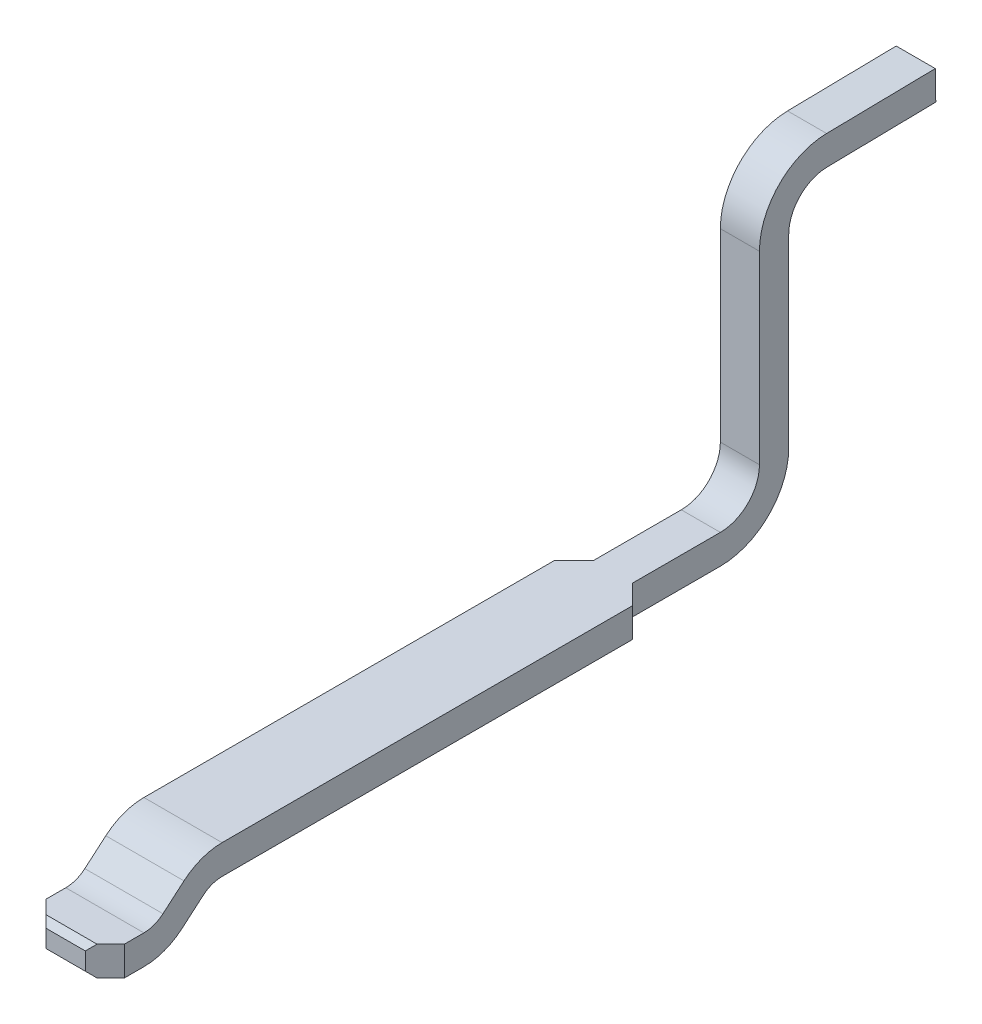
ISO-10303-21;
HEADER;
FILE_DESCRIPTION(('STEP AP214'),'2;1');
FILE_NAME('part.step','',(''),(''),'','','');
FILE_SCHEMA(('AUTOMOTIVE_DESIGN { 1 0 10303 214 1 1 1 1 }'));
ENDSEC;
DATA;
#1=APPLICATION_CONTEXT('core data for automotive mechanical design processes');
#2=APPLICATION_PROTOCOL_DEFINITION('international standard','automotive_design',2000,#1);
#3=PRODUCT_CONTEXT('',#1,'mechanical');
#4=PRODUCT('Part','Part','',(#3));
#5=PRODUCT_RELATED_PRODUCT_CATEGORY('part','',(#4));
#6=PRODUCT_DEFINITION_FORMATION('','',#4);
#7=PRODUCT_DEFINITION_CONTEXT('part definition',#1,'design');
#8=PRODUCT_DEFINITION('design','',#6,#7);
#9=PRODUCT_DEFINITION_SHAPE('','',#8);
#10=(LENGTH_UNIT() NAMED_UNIT(*) SI_UNIT(.MILLI.,.METRE.));
#11=(NAMED_UNIT(*) PLANE_ANGLE_UNIT() SI_UNIT($,.RADIAN.));
#12=(NAMED_UNIT(*) SI_UNIT($,.STERADIAN.) SOLID_ANGLE_UNIT());
#13=UNCERTAINTY_MEASURE_WITH_UNIT(LENGTH_MEASURE(1.E-05),#10,'distance_accuracy_value','');
#14=(GEOMETRIC_REPRESENTATION_CONTEXT(3) GLOBAL_UNCERTAINTY_ASSIGNED_CONTEXT((#13)) GLOBAL_UNIT_ASSIGNED_CONTEXT((#10,
#11,#12)) REPRESENTATION_CONTEXT('',''));
#15=CARTESIAN_POINT('',(0.,0.,0.));
#16=DIRECTION('',(0.,0.,1.));
#17=DIRECTION('',(1.,0.,0.));
#18=AXIS2_PLACEMENT_3D('',#15,#16,#17);
#19=CARTESIAN_POINT('',(-2.89596503503213,8.074228109921,4.324047830079));
#20=DIRECTION('',(0.,0.707106781186548,0.707106781186548));
#21=DIRECTION('',(0.,-0.707106781186548,0.707106781186548));
#22=AXIS2_PLACEMENT_3D('',#19,#20,#21);
#23=PLANE('',#22);
#24=DIRECTION('',(-0.577350269189631,0.577350269189615,-0.577350269189631));
#25=VECTOR('',#24,1.);
#26=CARTESIAN_POINT('',(-2.86026690000013,8.04019892,4.35807702));
#27=LINE('',#26,#25);
#28=CARTESIAN_POINT('',(-2.86026690000013,8.04019892,4.35807702));
#29=VERTEX_POINT('',#28);
#30=CARTESIAN_POINT('',(-2.89026690000013,8.07019892,4.32807702));
#31=VERTEX_POINT('',#30);
#32=EDGE_CURVE('E186',#29,#31,#27,.T.);
#33=ORIENTED_EDGE('',*,*,#32,.F.);
#34=DIRECTION('',(-1.,0.,0.));
#35=VECTOR('',#34,1.);
#36=CARTESIAN_POINT('',(-2.65456876496813,8.04019892,4.35807702));
#37=LINE('',#36,#35);
#38=CARTESIAN_POINT('',(-2.66026690000013,8.04019892,4.35807702));
#39=VERTEX_POINT('',#38);
#40=EDGE_CURVE('E179',#29,#39,#37,.F.);
#41=ORIENTED_EDGE('',*,*,#40,.T.);
#42=DIRECTION('',(-0.577350269189631,-0.577350269189606,0.57735026918964));
#43=VECTOR('',#42,1.);
#44=CARTESIAN_POINT('',(-2.63026690000013,8.07019892,4.32807702));
#45=LINE('',#44,#43);
#46=CARTESIAN_POINT('',(-2.63026690000013,8.07019892,4.32807702));
#47=VERTEX_POINT('',#46);
#48=EDGE_CURVE('E302',#47,#39,#45,.T.);
#49=ORIENTED_EDGE('',*,*,#48,.F.);
#50=DIRECTION('',(1.,0.,0.));
#51=VECTOR('',#50,1.);
#52=CARTESIAN_POINT('',(-2.55226690000013,8.07019892,4.32807702));
#53=LINE('',#52,#51);
#54=EDGE_CURVE('E309',#31,#47,#53,.T.);
#55=ORIENTED_EDGE('',*,*,#54,.F.);
#56=EDGE_LOOP('',(#33,#41,#49,#55));
#57=FACE_BOUND('',#56,.T.);
#58=ADVANCED_FACE('F17',(#57),#23,.T.);
#59=CARTESIAN_POINT('',(-2.65456876496813,7.944500784968,4.35807702));
#60=DIRECTION('',(0.,0.,-1.));
#61=DIRECTION('',(-1.,0.,0.));
#62=AXIS2_PLACEMENT_3D('',#59,#60,#61);
#63=PLANE('',#62);
#64=DIRECTION('',(0.,1.,0.));
#65=VECTOR('',#64,1.);
#66=CARTESIAN_POINT('',(-2.66026690000013,7.914500784968,4.35807702));
#67=LINE('',#66,#65);
#68=CARTESIAN_POINT('',(-2.66026690000013,7.95019892,4.35807702));
#69=VERTEX_POINT('',#68);
#70=EDGE_CURVE('E289',#39,#69,#67,.F.);
#71=ORIENTED_EDGE('',*,*,#70,.F.);
#72=ORIENTED_EDGE('',*,*,#40,.F.);
#73=DIRECTION('',(0.,1.,0.));
#74=VECTOR('',#73,1.);
#75=CARTESIAN_POINT('',(-2.86026690000013,7.914500784968,4.35807702));
#76=LINE('',#75,#74);
#77=CARTESIAN_POINT('',(-2.86026690000013,7.95019892,4.35807702));
#78=VERTEX_POINT('',#77);
#79=EDGE_CURVE('E368',#78,#29,#76,.T.);
#80=ORIENTED_EDGE('',*,*,#79,.F.);
#81=DIRECTION('',(1.,0.,0.));
#82=VECTOR('',#81,1.);
#83=CARTESIAN_POINT('',(-2.62456876496813,7.95019892,4.35807702));
#84=LINE('',#83,#82);
#85=EDGE_CURVE('E359',#69,#78,#84,.F.);
#86=ORIENTED_EDGE('',*,*,#85,.F.);
#87=EDGE_LOOP('',(#71,#72,#80,#86));
#88=FACE_BOUND('',#87,.T.);
#89=ADVANCED_FACE('F778',(#88),#63,.F.);
#90=CARTESIAN_POINT('',(-2.62456876496813,7.916169730079,4.324047830079));
#91=DIRECTION('',(0.,-0.707106781186548,0.707106781186548));
#92=DIRECTION('',(0.,-0.707106781186548,-0.707106781186548));
#93=AXIS2_PLACEMENT_3D('',#90,#91,#92);
#94=PLANE('',#93);
#95=DIRECTION('',(0.57735026918962,-0.577350269189629,-0.577350269189629));
#96=VECTOR('',#95,1.);
#97=CARTESIAN_POINT('',(-2.66026690000013,7.95019892,4.35807702));
#98=LINE('',#97,#96);
#99=CARTESIAN_POINT('',(-2.63026690000013,7.92019892,4.32807702));
#100=VERTEX_POINT('',#99);
#101=EDGE_CURVE('E303',#69,#100,#98,.T.);
#102=ORIENTED_EDGE('',*,*,#101,.F.);
#103=ORIENTED_EDGE('',*,*,#85,.T.);
#104=DIRECTION('',(0.57735026918962,0.577350269189637,0.57735026918962));
#105=VECTOR('',#104,1.);
#106=CARTESIAN_POINT('',(-2.89026690000013,7.92019892,4.32807702));
#107=LINE('',#106,#105);
#108=CARTESIAN_POINT('',(-2.89026690000013,7.92019892,4.32807702));
#109=VERTEX_POINT('',#108);
#110=EDGE_CURVE('E344',#109,#78,#107,.T.);
#111=ORIENTED_EDGE('',*,*,#110,.F.);
#112=DIRECTION('',(1.,0.,0.));
#113=VECTOR('',#112,1.);
#114=CARTESIAN_POINT('',(-2.55226690000013,7.92019892,4.32807702));
#115=LINE('',#114,#113);
#116=EDGE_CURVE('E284',#109,#100,#115,.T.);
#117=ORIENTED_EDGE('',*,*,#116,.T.);
#118=EDGE_LOOP('',(#102,#103,#111,#117));
#119=FACE_BOUND('',#118,.T.);
#120=ADVANCED_FACE('F771',(#119),#94,.T.);
#121=CARTESIAN_POINT('',(-2.65456876496813,8.45127780084181,0.758077020000001));
#122=DIRECTION('',(0.,0.,-1.));
#123=DIRECTION('',(-1.,0.,0.));
#124=AXIS2_PLACEMENT_3D('',#121,#122,#123);
#125=PLANE('',#124);
#126=DIRECTION('',(0.,1.,0.));
#127=VECTOR('',#126,1.);
#128=CARTESIAN_POINT('',(-2.66026690000013,9.610333059471,0.758077020000001));
#129=LINE('',#128,#127);
#130=CARTESIAN_POINT('',(-2.66026690000013,8.47019892,0.758077020000001));
#131=VERTEX_POINT('',#130);
#132=CARTESIAN_POINT('',(-2.66026690000013,9.41625487791,0.758077020000001));
#133=VERTEX_POINT('',#132);
#134=EDGE_CURVE('E253',#131,#133,#129,.T.);
#135=ORIENTED_EDGE('',*,*,#134,.F.);
#136=DIRECTION('',(-1.,0.,0.));
#137=VECTOR('',#136,1.);
#138=CARTESIAN_POINT('',(-2.66026690000013,8.47019892,0.75807702));
#139=LINE('',#138,#137);
#140=CARTESIAN_POINT('',(-2.86026690000013,8.47019892,0.758077020000001));
#141=VERTEX_POINT('',#140);
#142=EDGE_CURVE('E361',#141,#131,#139,.F.);
#143=ORIENTED_EDGE('',*,*,#142,.F.);
#144=DIRECTION('',(0.,1.,0.));
#145=VECTOR('',#144,1.);
#146=CARTESIAN_POINT('',(-2.86026690000013,8.45127780084181,0.758077020000001));
#147=LINE('',#146,#145);
#148=CARTESIAN_POINT('',(-2.86026690000013,9.41625487791,0.758077020000001));
#149=VERTEX_POINT('',#148);
#150=EDGE_CURVE('E235',#149,#141,#147,.F.);
#151=ORIENTED_EDGE('',*,*,#150,.F.);
#152=DIRECTION('',(1.,0.,0.));
#153=VECTOR('',#152,1.);
#154=CARTESIAN_POINT('',(-2.86026690000013,9.41625487791,0.758077020000001));
#155=LINE('',#154,#153);
#156=EDGE_CURVE('E342',#149,#133,#155,.T.);
#157=ORIENTED_EDGE('',*,*,#156,.T.);
#158=EDGE_LOOP('',(#135,#143,#151,#157));
#159=FACE_BOUND('',#158,.T.);
#160=ADVANCED_FACE('F474',(#159),#125,.T.);
#161=CARTESIAN_POINT('',(-2.66026690000013,8.47019892,1.10807702));
#162=DIRECTION('',(-1.,0.,0.));
#163=DIRECTION('',(0.,0.,1.));
#164=AXIS2_PLACEMENT_3D('',#161,#162,#163);
#165=CYLINDRICAL_SURFACE('',#164,0.2);
#166=DIRECTION('',(1.,0.,0.));
#167=VECTOR('',#166,1.);
#168=CARTESIAN_POINT('',(-2.55226690000013,8.27019892,1.10807702));
#169=LINE('',#168,#167);
#170=CARTESIAN_POINT('',(-2.66026690000013,8.27019892,1.10807702));
#171=VERTEX_POINT('',#170);
#172=CARTESIAN_POINT('',(-2.86026690000013,8.27019892,1.10807702));
#173=VERTEX_POINT('',#172);
#174=EDGE_CURVE('E317',#171,#173,#169,.F.);
#175=ORIENTED_EDGE('',*,*,#174,.F.);
#176=CARTESIAN_POINT('',(-2.66026690000013,8.47019892,1.10807702));
#177=DIRECTION('',(-1.,0.,0.));
#178=DIRECTION('',(0.,0.,1.));
#179=AXIS2_PLACEMENT_3D('',#176,#177,#178);
#180=CIRCLE('',#179,0.2);
#181=CARTESIAN_POINT('',(-2.66026690000013,8.47019892,0.908077020000001));
#182=VERTEX_POINT('',#181);
#183=EDGE_CURVE('E259',#182,#171,#180,.T.);
#184=ORIENTED_EDGE('',*,*,#183,.F.);
#185=DIRECTION('',(-1.,0.,0.));
#186=VECTOR('',#185,1.);
#187=CARTESIAN_POINT('',(-2.65456876496813,8.47019892,0.908077020000001));
#188=LINE('',#187,#186);
#189=CARTESIAN_POINT('',(-2.86026690000013,8.47019892,0.908077020000001));
#190=VERTEX_POINT('',#189);
#191=EDGE_CURVE('E356',#182,#190,#188,.T.);
#192=ORIENTED_EDGE('',*,*,#191,.T.);
#193=CARTESIAN_POINT('',(-2.86026690000013,8.47019892,1.10807702));
#194=DIRECTION('',(-1.,0.,0.));
#195=DIRECTION('',(0.,0.,1.));
#196=AXIS2_PLACEMENT_3D('',#193,#194,#195);
#197=CIRCLE('',#196,0.2);
#198=EDGE_CURVE('E228',#173,#190,#197,.F.);
#199=ORIENTED_EDGE('',*,*,#198,.F.);
#200=EDGE_LOOP('',(#175,#184,#192,#199));
#201=FACE_BOUND('',#200,.T.);
#202=ADVANCED_FACE('F441',(#201),#165,.F.);
#203=CARTESIAN_POINT('',(-2.65456876496813,8.45127780084181,0.908077020000001));
#204=DIRECTION('',(0.,0.,-1.));
#205=DIRECTION('',(-1.,0.,0.));
#206=AXIS2_PLACEMENT_3D('',#203,#204,#205);
#207=PLANE('',#206);
#208=ORIENTED_EDGE('',*,*,#191,.F.);
#209=DIRECTION('',(0.,1.,0.));
#210=VECTOR('',#209,1.);
#211=CARTESIAN_POINT('',(-2.66026690000013,9.610333059471,0.908077020000001));
#212=LINE('',#211,#210);
#213=CARTESIAN_POINT('',(-2.66026690000013,9.41625487791,0.908077020000001));
#214=VERTEX_POINT('',#213);
#215=EDGE_CURVE('E262',#214,#182,#212,.F.);
#216=ORIENTED_EDGE('',*,*,#215,.F.);
#217=DIRECTION('',(1.,0.,0.));
#218=VECTOR('',#217,1.);
#219=CARTESIAN_POINT('',(-2.86026690000013,9.41625487791,0.908077020000001));
#220=LINE('',#219,#218);
#221=CARTESIAN_POINT('',(-2.86026690000013,9.41625487791,0.908077020000001));
#222=VERTEX_POINT('',#221);
#223=EDGE_CURVE('E354',#222,#214,#220,.T.);
#224=ORIENTED_EDGE('',*,*,#223,.F.);
#225=DIRECTION('',(0.,1.,0.));
#226=VECTOR('',#225,1.);
#227=CARTESIAN_POINT('',(-2.86026690000013,8.45127780084181,0.908077020000001));
#228=LINE('',#227,#226);
#229=EDGE_CURVE('E226',#190,#222,#228,.T.);
#230=ORIENTED_EDGE('',*,*,#229,.F.);
#231=EDGE_LOOP('',(#208,#216,#224,#230));
#232=FACE_BOUND('',#231,.T.);
#233=ADVANCED_FACE('F750',(#232),#207,.F.);
#234=CARTESIAN_POINT('',(-2.86026690000013,9.41625487791,0.558077020000001));
#235=DIRECTION('',(1.,0.,0.));
#236=DIRECTION('',(0.,0.,-1.));
#237=AXIS2_PLACEMENT_3D('',#234,#235,#236);
#238=CYLINDRICAL_SURFACE('',#237,0.35);
#239=ORIENTED_EDGE('',*,*,#223,.T.);
#240=CARTESIAN_POINT('',(-2.66026690000013,9.41625487791,0.558077020000001));
#241=DIRECTION('',(1.,0.,0.));
#242=DIRECTION('',(0.,0.,-1.));
#243=AXIS2_PLACEMENT_3D('',#240,#241,#242);
#244=CIRCLE('',#243,0.35);
#245=CARTESIAN_POINT('',(-2.66026690000013,9.76620157121429,0.564185362253241));
#246=VERTEX_POINT('',#245);
#247=EDGE_CURVE('E20',#246,#214,#244,.T.);
#248=ORIENTED_EDGE('',*,*,#247,.F.);
#249=DIRECTION('',(1.,0.,0.));
#250=VECTOR('',#249,1.);
#251=CARTESIAN_POINT('',(-2.86596503503213,9.76620157121458,0.564185362253011));
#252=LINE('',#251,#250);
#253=CARTESIAN_POINT('',(-2.86026690000013,9.76620157121429,0.564185362253241));
#254=VERTEX_POINT('',#253);
#255=EDGE_CURVE('E143',#254,#246,#252,.T.);
#256=ORIENTED_EDGE('',*,*,#255,.F.);
#257=CARTESIAN_POINT('',(-2.86026690000013,9.41625487791,0.558077020000001));
#258=DIRECTION('',(1.,0.,0.));
#259=DIRECTION('',(0.,0.,-1.));
#260=AXIS2_PLACEMENT_3D('',#257,#258,#259);
#261=CIRCLE('',#260,0.35);
#262=EDGE_CURVE('E223',#222,#254,#261,.F.);
#263=ORIENTED_EDGE('',*,*,#262,.F.);
#264=EDGE_LOOP('',(#239,#248,#256,#263));
#265=FACE_BOUND('',#264,.T.);
#266=ADVANCED_FACE('F743',(#265),#238,.T.);
#267=CARTESIAN_POINT('',(-2.86596503503213,9.766007480923,0.575304787611001));
#268=DIRECTION('',(0.,0.999847695156406,0.0174524064364471));
#269=DIRECTION('',(0.,-0.0174524064364471,0.999847695156406));
#270=AXIS2_PLACEMENT_3D('',#267,#268,#269);
#271=PLANE('',#270);
#272=DIRECTION('',(0.,0.0174524064385203,-0.99984769515637));
#273=VECTOR('',#272,1.);
#274=CARTESIAN_POINT('',(-2.86026690000013,9.766201571214,0.564185362253001));
#275=LINE('',#274,#273);
#276=CARTESIAN_POINT('',(-2.86026690000013,9.775906085794,0.00821409435916126));
#277=VERTEX_POINT('',#276);
#278=EDGE_CURVE('E199',#254,#277,#275,.T.);
#279=ORIENTED_EDGE('',*,*,#278,.F.);
#280=ORIENTED_EDGE('',*,*,#255,.T.);
#281=DIRECTION('',(0.,-0.0174524064385203,0.99984769515637));
#282=VECTOR('',#281,1.);
#283=CARTESIAN_POINT('',(-2.66026690000013,9.775906085794,0.00821409435900074));
#284=LINE('',#283,#282);
#285=CARTESIAN_POINT('',(-2.66026690000013,9.775906085794,0.00821409435916126));
#286=VERTEX_POINT('',#285);
#287=EDGE_CURVE('E265',#286,#246,#284,.T.);
#288=ORIENTED_EDGE('',*,*,#287,.F.);
#289=DIRECTION('',(1.,0.,0.));
#290=VECTOR('',#289,1.);
#291=CARTESIAN_POINT('',(-2.65456876496813,9.77590608579399,0.0082140943594823));
#292=LINE('',#291,#290);
#293=EDGE_CURVE('E153',#277,#286,#292,.T.);
#294=ORIENTED_EDGE('',*,*,#293,.F.);
#295=EDGE_LOOP('',(#279,#280,#288,#294));
#296=FACE_BOUND('',#295,.T.);
#297=ADVANCED_FACE('F736',(#296),#271,.T.);
#298=CARTESIAN_POINT('',(-2.65456876496813,9.620231664342,0.00549678722500089));
#299=DIRECTION('',(0.,0.0174524064396861,-0.999847695156349));
#300=DIRECTION('',(0.,0.999847695156349,0.0174524064396861));
#301=AXIS2_PLACEMENT_3D('',#298,#299,#300);
#302=PLANE('',#301);
#303=DIRECTION('',(1.,0.,0.));
#304=VECTOR('',#303,1.);
#305=CARTESIAN_POINT('',(-2.86596503503213,9.62592893152041,0.00559623339400797));
#306=LINE('',#305,#304);
#307=CARTESIAN_POINT('',(-2.66026690000013,9.62592893152018,0.00559623339400417));
#308=VERTEX_POINT('',#307);
#309=CARTESIAN_POINT('',(-2.86026690000013,9.62592893152014,0.00559623339400334));
#310=VERTEX_POINT('',#309);
#311=EDGE_CURVE('E202',#308,#310,#306,.F.);
#312=ORIENTED_EDGE('',*,*,#311,.T.);
#313=DIRECTION('',(0.,-0.999847695156461,-0.0174524064332696));
#314=VECTOR('',#313,1.);
#315=CARTESIAN_POINT('',(-2.86026690000013,9.775906085794,0.00821409435900074));
#316=LINE('',#315,#314);
#317=EDGE_CURVE('E192',#277,#310,#316,.T.);
#318=ORIENTED_EDGE('',*,*,#317,.F.);
#319=ORIENTED_EDGE('',*,*,#293,.T.);
#320=DIRECTION('',(0.,0.999847695156461,0.0174524064332696));
#321=VECTOR('',#320,1.);
#322=CARTESIAN_POINT('',(-2.66026690000013,9.62592893152,0.00559623339400103));
#323=LINE('',#322,#321);
#324=EDGE_CURVE('E204',#308,#286,#323,.T.);
#325=ORIENTED_EDGE('',*,*,#324,.F.);
#326=EDGE_LOOP('',(#312,#318,#319,#325));
#327=FACE_BOUND('',#326,.T.);
#328=ADVANCED_FACE('F203',(#327),#302,.T.);
#329=CARTESIAN_POINT('',(-2.86596503503213,9.616030326649,0.572686926645001));
#330=DIRECTION('',(0.,0.999847695156375,0.0174524064382066));
#331=DIRECTION('',(0.,-0.0174524064382066,0.999847695156375));
#332=AXIS2_PLACEMENT_3D('',#329,#330,#331);
#333=PLANE('',#332);
#334=DIRECTION('',(1.,0.,0.));
#335=VECTOR('',#334,1.);
#336=CARTESIAN_POINT('',(-2.86026690000013,9.61622441694128,0.561567501287006));
#337=LINE('',#336,#335);
#338=CARTESIAN_POINT('',(-2.66026690000013,9.61622441694114,0.561567501287176));
#339=VERTEX_POINT('',#338);
#340=CARTESIAN_POINT('',(-2.86026690000013,9.61622441694114,0.561567501287176));
#341=VERTEX_POINT('',#340);
#342=EDGE_CURVE('E208',#339,#341,#337,.F.);
#343=ORIENTED_EDGE('',*,*,#342,.T.);
#344=DIRECTION('',(0.,-0.0174524064367521,0.999847695156401));
#345=VECTOR('',#344,1.);
#346=CARTESIAN_POINT('',(-2.86026690000013,9.62592893152,0.00559623339400103));
#347=LINE('',#346,#345);
#348=EDGE_CURVE('E197',#310,#341,#347,.T.);
#349=ORIENTED_EDGE('',*,*,#348,.F.);
#350=ORIENTED_EDGE('',*,*,#311,.F.);
#351=DIRECTION('',(0.,0.0174524064367521,-0.999847695156401));
#352=VECTOR('',#351,1.);
#353=CARTESIAN_POINT('',(-2.66026690000013,9.616224416941,0.561567501287001));
#354=LINE('',#353,#352);
#355=EDGE_CURVE('E248',#339,#308,#354,.T.);
#356=ORIENTED_EDGE('',*,*,#355,.F.);
#357=EDGE_LOOP('',(#343,#349,#350,#356));
#358=FACE_BOUND('',#357,.T.);
#359=ADVANCED_FACE('F210',(#358),#333,.F.);
#360=CARTESIAN_POINT('',(-2.86026690000013,9.41625487791,0.558077020000001));
#361=DIRECTION('',(1.,0.,0.));
#362=DIRECTION('',(0.,0.,-1.));
#363=AXIS2_PLACEMENT_3D('',#360,#361,#362);
#364=CYLINDRICAL_SURFACE('',#363,0.2);
#365=ORIENTED_EDGE('',*,*,#156,.F.);
#366=CARTESIAN_POINT('',(-2.86026690000013,9.41625487791,0.558077020000001));
#367=DIRECTION('',(1.,0.,0.));
#368=DIRECTION('',(0.,0.,-1.));
#369=AXIS2_PLACEMENT_3D('',#366,#367,#368);
#370=CIRCLE('',#369,0.2);
#371=EDGE_CURVE('E212',#341,#149,#370,.T.);
#372=ORIENTED_EDGE('',*,*,#371,.F.);
#373=ORIENTED_EDGE('',*,*,#342,.F.);
#374=CARTESIAN_POINT('',(-2.66026690000013,9.41625487791,0.558077020000001));
#375=DIRECTION('',(1.,0.,0.));
#376=DIRECTION('',(0.,0.,-1.));
#377=AXIS2_PLACEMENT_3D('',#374,#375,#376);
#378=CIRCLE('',#377,0.2);
#379=EDGE_CURVE('E250',#133,#339,#378,.F.);
#380=ORIENTED_EDGE('',*,*,#379,.F.);
#381=EDGE_LOOP('',(#365,#372,#373,#380));
#382=FACE_BOUND('',#381,.T.);
#383=ADVANCED_FACE('F476',(#382),#364,.F.);
#384=CARTESIAN_POINT('',(-2.96429608992113,7.914500784968,4.254047830079));
#385=DIRECTION('',(-0.707106781186548,0.,0.707106781186548));
#386=DIRECTION('',(0.707106781186548,0.,0.707106781186548));
#387=AXIS2_PLACEMENT_3D('',#384,#385,#386);
#388=PLANE('',#387);
#389=DIRECTION('',(0.,1.,0.));
#390=VECTOR('',#389,1.);
#391=CARTESIAN_POINT('',(-2.96026690000013,7.914500784968,4.25807702));
#392=LINE('',#391,#390);
#393=CARTESIAN_POINT('',(-2.96026690000013,8.07019892,4.25807702));
#394=VERTEX_POINT('',#393);
#395=CARTESIAN_POINT('',(-2.96026690000013,7.92019892,4.25807702));
#396=VERTEX_POINT('',#395);
#397=EDGE_CURVE('E332',#394,#396,#392,.F.);
#398=ORIENTED_EDGE('',*,*,#397,.T.);
#399=DIRECTION('',(0.707106781186543,0.,0.707106781186552));
#400=VECTOR('',#399,1.);
#401=CARTESIAN_POINT('',(-2.96026690000013,7.92019892,4.25807702));
#402=LINE('',#401,#400);
#403=EDGE_CURVE('E288',#396,#109,#402,.T.);
#404=ORIENTED_EDGE('',*,*,#403,.T.);
#405=ORIENTED_EDGE('',*,*,#110,.T.);
#406=ORIENTED_EDGE('',*,*,#79,.T.);
#407=ORIENTED_EDGE('',*,*,#32,.T.);
#408=DIRECTION('',(0.707106781186543,0.,0.707106781186552));
#409=VECTOR('',#408,1.);
#410=CARTESIAN_POINT('',(-2.96026690000013,8.07019892,4.25807702));
#411=LINE('',#410,#409);
#412=EDGE_CURVE('E308',#394,#31,#411,.T.);
#413=ORIENTED_EDGE('',*,*,#412,.F.);
#414=EDGE_LOOP('',(#398,#404,#405,#406,#407,#413));
#415=FACE_BOUND('',#414,.T.);
#416=ADVANCED_FACE('F565',(#415),#388,.T.);
#417=CARTESIAN_POINT('',(-2.55226690000013,8.27019892,3.81107702));
#418=DIRECTION('',(0.,1.,0.));
#419=DIRECTION('',(0.,0.,1.));
#420=AXIS2_PLACEMENT_3D('',#417,#418,#419);
#421=PLANE('',#420);
#422=DIRECTION('',(0.,0.,-1.));
#423=VECTOR('',#422,1.);
#424=CARTESIAN_POINT('',(-2.56026690000013,8.27019892,3.80007702));
#425=LINE('',#424,#423);
#426=CARTESIAN_POINT('',(-2.56026690000013,8.27019892,1.65807702));
#427=VERTEX_POINT('',#426);
#428=CARTESIAN_POINT('',(-2.56026690000013,8.27019892,3.75807702));
#429=VERTEX_POINT('',#428);
#430=EDGE_CURVE('E411',#427,#429,#425,.F.);
#431=ORIENTED_EDGE('',*,*,#430,.F.);
#432=DIRECTION('',(-0.707106781186548,0.,-0.707106781186548));
#433=VECTOR('',#432,1.);
#434=CARTESIAN_POINT('',(-2.66429608992113,8.27019892,1.554047830079));
#435=LINE('',#434,#433);
#436=CARTESIAN_POINT('',(-2.66026690000013,8.27019892,1.55807702));
#437=VERTEX_POINT('',#436);
#438=EDGE_CURVE('E267',#437,#427,#435,.F.);
#439=ORIENTED_EDGE('',*,*,#438,.F.);
#440=DIRECTION('',(0.,0.,-1.));
#441=VECTOR('',#440,1.);
#442=CARTESIAN_POINT('',(-2.66026690000013,8.27019892,0.572587480477));
#443=LINE('',#442,#441);
#444=EDGE_CURVE('E256',#171,#437,#443,.F.);
#445=ORIENTED_EDGE('',*,*,#444,.F.);
#446=ORIENTED_EDGE('',*,*,#174,.T.);
#447=DIRECTION('',(0.,0.,1.));
#448=VECTOR('',#447,1.);
#449=CARTESIAN_POINT('',(-2.86026690000013,8.27019892,0.913775155032));
#450=LINE('',#449,#448);
#451=CARTESIAN_POINT('',(-2.86026690000013,8.27019892,1.55807702));
#452=VERTEX_POINT('',#451);
#453=EDGE_CURVE('E229',#452,#173,#450,.F.);
#454=ORIENTED_EDGE('',*,*,#453,.F.);
#455=DIRECTION('',(-0.707106781186548,0.,0.707106781186548));
#456=VECTOR('',#455,1.);
#457=CARTESIAN_POINT('',(-2.96429608992113,8.27019892,1.662106209921));
#458=LINE('',#457,#456);
#459=CARTESIAN_POINT('',(-2.96026690000013,8.27019892,1.65807702));
#460=VERTEX_POINT('',#459);
#461=EDGE_CURVE('E322',#460,#452,#458,.F.);
#462=ORIENTED_EDGE('',*,*,#461,.F.);
#463=DIRECTION('',(0.,0.,-1.));
#464=VECTOR('',#463,1.);
#465=CARTESIAN_POINT('',(-2.96026690000013,8.27019892,4.163775155032));
#466=LINE('',#465,#464);
#467=CARTESIAN_POINT('',(-2.96026690000013,8.27019892,3.75807702));
#468=VERTEX_POINT('',#467);
#469=EDGE_CURVE('E421',#460,#468,#466,.F.);
#470=ORIENTED_EDGE('',*,*,#469,.T.);
#471=DIRECTION('',(-1.,0.,0.));
#472=VECTOR('',#471,1.);
#473=CARTESIAN_POINT('',(-2.56026690000013,8.27019892,3.75807702));
#474=LINE('',#473,#472);
#475=EDGE_CURVE('E315',#429,#468,#474,.T.);
#476=ORIENTED_EDGE('',*,*,#475,.F.);
#477=EDGE_LOOP('',(#431,#439,#445,#446,#454,#462,#470,#476));
#478=FACE_BOUND('',#477,.T.);
#479=ADVANCED_FACE('F445',(#478),#421,.T.);
#480=CARTESIAN_POINT('',(-2.56026690000013,7.97019892,3.75807702));
#481=DIRECTION('',(-1.,0.,0.));
#482=DIRECTION('',(0.,0.,1.));
#483=AXIS2_PLACEMENT_3D('',#480,#481,#482);
#484=CYLINDRICAL_SURFACE('',#483,0.3);
#485=CARTESIAN_POINT('',(-2.96026690000013,7.97019892,3.75807702));
#486=DIRECTION('',(-1.,0.,0.));
#487=DIRECTION('',(0.,0.,1.));
#488=AXIS2_PLACEMENT_3D('',#485,#486,#487);
#489=CIRCLE('',#488,0.3);
#490=CARTESIAN_POINT('',(-2.96026690000013,8.19815650538647,3.9531035291326));
#491=VERTEX_POINT('',#490);
#492=EDGE_CURVE('E418',#468,#491,#489,.F.);
#493=ORIENTED_EDGE('',*,*,#492,.T.);
#494=DIRECTION('',(1.,0.,0.));
#495=VECTOR('',#494,1.);
#496=CARTESIAN_POINT('',(-2.55226690000013,8.19815650538616,3.95310352913313));
#497=LINE('',#496,#495);
#498=CARTESIAN_POINT('',(-2.56026690000013,8.19815650538647,3.9531035291326));
#499=VERTEX_POINT('',#498);
#500=EDGE_CURVE('E313',#499,#491,#497,.F.);
#501=ORIENTED_EDGE('',*,*,#500,.F.);
#502=CARTESIAN_POINT('',(-2.56026690000013,7.97019892,3.75807702));
#503=DIRECTION('',(-1.,0.,0.));
#504=DIRECTION('',(0.,0.,1.));
#505=AXIS2_PLACEMENT_3D('',#502,#503,#504);
#506=CIRCLE('',#505,0.3);
#507=EDGE_CURVE('E409',#429,#499,#506,.F.);
#508=ORIENTED_EDGE('',*,*,#507,.F.);
#509=ORIENTED_EDGE('',*,*,#475,.T.);
#510=EDGE_LOOP('',(#493,#501,#508,#509));
#511=FACE_BOUND('',#510,.T.);
#512=ADVANCED_FACE('F585',(#511),#484,.T.);
#513=CARTESIAN_POINT('',(-2.55226690000013,8.102515836027,4.064893542443));
#514=DIRECTION('',(0.,0.759858617954068,0.650088363779058));
#515=DIRECTION('',(0.,-0.650088363779058,0.759858617954068));
#516=AXIS2_PLACEMENT_3D('',#513,#514,#515);
#517=PLANE('',#516);
#518=DIRECTION('',(0.,-0.650088363774947,0.759858617957586));
#519=VECTOR('',#518,1.);
#520=CARTESIAN_POINT('',(-2.96026690000013,8.198156505386,3.953103529133));
#521=LINE('',#520,#519);
#522=CARTESIAN_POINT('',(-2.96026690000013,8.10622012730668,4.06056376543338));
#523=VERTEX_POINT('',#522);
#524=EDGE_CURVE('E417',#491,#523,#521,.T.);
#525=ORIENTED_EDGE('',*,*,#524,.T.);
#526=DIRECTION('',(-1.,0.,0.));
#527=VECTOR('',#526,1.);
#528=CARTESIAN_POINT('',(-2.56026690000013,8.10622012730701,4.06056376543301));
#529=LINE('',#528,#527);
#530=CARTESIAN_POINT('',(-2.56026690000013,8.10622012730668,4.06056376543338));
#531=VERTEX_POINT('',#530);
#532=EDGE_CURVE('E310',#523,#531,#529,.F.);
#533=ORIENTED_EDGE('',*,*,#532,.T.);
#534=DIRECTION('',(0.,-0.650088363774947,0.759858617957586));
#535=VECTOR('',#534,1.);
#536=CARTESIAN_POINT('',(-2.56026690000013,8.198156505386,3.953103529133));
#537=LINE('',#536,#535);
#538=EDGE_CURVE('E408',#499,#531,#537,.T.);
#539=ORIENTED_EDGE('',*,*,#538,.F.);
#540=ORIENTED_EDGE('',*,*,#500,.T.);
#541=EDGE_LOOP('',(#525,#533,#539,#540));
#542=FACE_BOUND('',#541,.T.);
#543=ADVANCED_FACE('F580',(#542),#517,.T.);
#544=CARTESIAN_POINT('',(-2.56026690000013,8.22019892,4.15807702));
#545=DIRECTION('',(-1.,0.,0.));
#546=DIRECTION('',(0.,0.,1.));
#547=AXIS2_PLACEMENT_3D('',#544,#545,#546);
#548=CYLINDRICAL_SURFACE('',#547,0.15);
#549=CARTESIAN_POINT('',(-2.96026690000013,8.22019892,4.15807702));
#550=DIRECTION('',(-1.,0.,0.));
#551=DIRECTION('',(0.,0.,1.));
#552=AXIS2_PLACEMENT_3D('',#549,#550,#551);
#553=CIRCLE('',#552,0.15);
#554=CARTESIAN_POINT('',(-2.96026690000013,8.07019892,4.15807702));
#555=VERTEX_POINT('',#554);
#556=EDGE_CURVE('E414',#523,#555,#553,.T.);
#557=ORIENTED_EDGE('',*,*,#556,.T.);
#558=DIRECTION('',(1.,0.,0.));
#559=VECTOR('',#558,1.);
#560=CARTESIAN_POINT('',(-2.55226690000013,8.07019892,4.15807702));
#561=LINE('',#560,#559);
#562=CARTESIAN_POINT('',(-2.56026690000013,8.07019892,4.15807702));
#563=VERTEX_POINT('',#562);
#564=EDGE_CURVE('E306',#563,#555,#561,.F.);
#565=ORIENTED_EDGE('',*,*,#564,.F.);
#566=CARTESIAN_POINT('',(-2.56026690000013,8.22019892,4.15807702));
#567=DIRECTION('',(-1.,0.,0.));
#568=DIRECTION('',(0.,0.,1.));
#569=AXIS2_PLACEMENT_3D('',#566,#567,#568);
#570=CIRCLE('',#569,0.15);
#571=EDGE_CURVE('E406',#531,#563,#570,.T.);
#572=ORIENTED_EDGE('',*,*,#571,.F.);
#573=ORIENTED_EDGE('',*,*,#532,.F.);
#574=EDGE_LOOP('',(#557,#565,#572,#573));
#575=FACE_BOUND('',#574,.T.);
#576=ADVANCED_FACE('F578',(#575),#548,.F.);
#577=CARTESIAN_POINT('',(-2.55226690000013,8.07019892,4.333775155032));
#578=DIRECTION('',(0.,1.,0.));
#579=DIRECTION('',(0.,0.,1.));
#580=AXIS2_PLACEMENT_3D('',#577,#578,#579);
#581=PLANE('',#580);
#582=DIRECTION('',(0.,0.,-1.));
#583=VECTOR('',#582,1.);
#584=CARTESIAN_POINT('',(-2.96026690000013,8.07019892,4.163775155032));
#585=LINE('',#584,#583);
#586=EDGE_CURVE('E325',#555,#394,#585,.F.);
#587=ORIENTED_EDGE('',*,*,#586,.T.);
#588=ORIENTED_EDGE('',*,*,#412,.T.);
#589=ORIENTED_EDGE('',*,*,#54,.T.);
#590=DIRECTION('',(0.707106781186548,0.,-0.707106781186548));
#591=VECTOR('',#590,1.);
#592=CARTESIAN_POINT('',(-2.66429608992113,8.07019892,4.362106209921));
#593=LINE('',#592,#591);
#594=CARTESIAN_POINT('',(-2.56026690000013,8.07019892,4.25807702));
#595=VERTEX_POINT('',#594);
#596=EDGE_CURVE('E299',#595,#47,#593,.F.);
#597=ORIENTED_EDGE('',*,*,#596,.F.);
#598=DIRECTION('',(0.,0.,-1.));
#599=VECTOR('',#598,1.);
#600=CARTESIAN_POINT('',(-2.56026690000013,8.07019892,3.80007702));
#601=LINE('',#600,#599);
#602=EDGE_CURVE('E296',#563,#595,#601,.F.);
#603=ORIENTED_EDGE('',*,*,#602,.F.);
#604=ORIENTED_EDGE('',*,*,#564,.T.);
#605=EDGE_LOOP('',(#587,#588,#589,#597,#603,#604));
#606=FACE_BOUND('',#605,.T.);
#607=ADVANCED_FACE('F572',(#606),#581,.T.);
#608=CARTESIAN_POINT('',(-2.66429608992113,7.914500784968,4.362106209921));
#609=DIRECTION('',(0.707106781186548,0.,0.707106781186548));
#610=DIRECTION('',(0.707106781186548,0.,-0.707106781186548));
#611=AXIS2_PLACEMENT_3D('',#608,#609,#610);
#612=PLANE('',#611);
#613=ORIENTED_EDGE('',*,*,#48,.T.);
#614=ORIENTED_EDGE('',*,*,#70,.T.);
#615=ORIENTED_EDGE('',*,*,#101,.T.);
#616=DIRECTION('',(0.707106781186548,0.,-0.707106781186548));
#617=VECTOR('',#616,1.);
#618=CARTESIAN_POINT('',(-2.63026690000013,7.92019892,4.32807702));
#619=LINE('',#618,#617);
#620=CARTESIAN_POINT('',(-2.56026690000013,7.92019892,4.25807702));
#621=VERTEX_POINT('',#620);
#622=EDGE_CURVE('E285',#100,#621,#619,.T.);
#623=ORIENTED_EDGE('',*,*,#622,.T.);
#624=DIRECTION('',(0.,1.,0.));
#625=VECTOR('',#624,1.);
#626=CARTESIAN_POINT('',(-2.56026690000013,8.114500784968,4.25807702));
#627=LINE('',#626,#625);
#628=EDGE_CURVE('E292',#595,#621,#627,.F.);
#629=ORIENTED_EDGE('',*,*,#628,.F.);
#630=ORIENTED_EDGE('',*,*,#596,.T.);
#631=EDGE_LOOP('',(#613,#614,#615,#623,#629,#630));
#632=FACE_BOUND('',#631,.T.);
#633=ADVANCED_FACE('F589',(#632),#612,.T.);
#634=CARTESIAN_POINT('',(-2.55226690000013,7.92019892,4.333775155032));
#635=DIRECTION('',(0.,1.,0.));
#636=DIRECTION('',(0.,0.,1.));
#637=AXIS2_PLACEMENT_3D('',#634,#635,#636);
#638=PLANE('',#637);
#639=ORIENTED_EDGE('',*,*,#403,.F.);
#640=DIRECTION('',(0.,0.,-1.));
#641=VECTOR('',#640,1.);
#642=CARTESIAN_POINT('',(-2.96026690000013,7.92019892,4.163775155032));
#643=LINE('',#642,#641);
#644=CARTESIAN_POINT('',(-2.96026690000013,7.92019892,4.15807702));
#645=VERTEX_POINT('',#644);
#646=EDGE_CURVE('E335',#396,#645,#643,.T.);
#647=ORIENTED_EDGE('',*,*,#646,.T.);
#648=DIRECTION('',(-1.,0.,0.));
#649=VECTOR('',#648,1.);
#650=CARTESIAN_POINT('',(-2.56026690000013,7.92019892,4.15807702));
#651=LINE('',#650,#649);
#652=CARTESIAN_POINT('',(-2.56026690000013,7.92019892,4.15807702));
#653=VERTEX_POINT('',#652);
#654=EDGE_CURVE('E282',#653,#645,#651,.T.);
#655=ORIENTED_EDGE('',*,*,#654,.F.);
#656=DIRECTION('',(0.,0.,-1.));
#657=VECTOR('',#656,1.);
#658=CARTESIAN_POINT('',(-2.56026690000013,7.92019892,3.80007702));
#659=LINE('',#658,#657);
#660=EDGE_CURVE('E295',#621,#653,#659,.T.);
#661=ORIENTED_EDGE('',*,*,#660,.F.);
#662=ORIENTED_EDGE('',*,*,#622,.F.);
#663=ORIENTED_EDGE('',*,*,#116,.F.);
#664=EDGE_LOOP('',(#639,#647,#655,#661,#662,#663));
#665=FACE_BOUND('',#664,.T.);
#666=ADVANCED_FACE('F596',(#665),#638,.F.);
#667=CARTESIAN_POINT('',(-2.56026690000013,8.22019892,4.15807702));
#668=DIRECTION('',(-1.,0.,0.));
#669=DIRECTION('',(0.,0.,1.));
#670=AXIS2_PLACEMENT_3D('',#667,#668,#669);
#671=CYLINDRICAL_SURFACE('',#670,0.3);
#672=CARTESIAN_POINT('',(-2.96026690000013,8.22019892,4.15807702));
#673=DIRECTION('',(-1.,0.,0.));
#674=DIRECTION('',(0.,0.,1.));
#675=AXIS2_PLACEMENT_3D('',#672,#673,#674);
#676=CIRCLE('',#675,0.3);
#677=CARTESIAN_POINT('',(-2.96026690000013,7.99224133461339,3.96305051086728));
#678=VERTEX_POINT('',#677);
#679=EDGE_CURVE('E422',#645,#678,#676,.F.);
#680=ORIENTED_EDGE('',*,*,#679,.T.);
#681=DIRECTION('',(1.,0.,0.));
#682=VECTOR('',#681,1.);
#683=CARTESIAN_POINT('',(-2.55226690000013,7.99224133461357,3.96305051086664));
#684=LINE('',#683,#682);
#685=CARTESIAN_POINT('',(-2.56026690000013,7.99224133461339,3.96305051086728));
#686=VERTEX_POINT('',#685);
#687=EDGE_CURVE('E279',#678,#686,#684,.T.);
#688=ORIENTED_EDGE('',*,*,#687,.T.);
#689=CARTESIAN_POINT('',(-2.56026690000013,8.22019892,4.15807702));
#690=DIRECTION('',(-1.,0.,0.));
#691=DIRECTION('',(0.,0.,1.));
#692=AXIS2_PLACEMENT_3D('',#689,#690,#691);
#693=CIRCLE('',#692,0.3);
#694=EDGE_CURVE('E404',#653,#686,#693,.F.);
#695=ORIENTED_EDGE('',*,*,#694,.F.);
#696=ORIENTED_EDGE('',*,*,#654,.T.);
#697=EDGE_LOOP('',(#680,#688,#695,#696));
#698=FACE_BOUND('',#697,.T.);
#699=ADVANCED_FACE('F598',(#698),#671,.T.);
#700=CARTESIAN_POINT('',(-2.55226690000013,7.988537043334,3.967380287877));
#701=DIRECTION('',(0.,0.759858617954068,0.650088363779058));
#702=DIRECTION('',(0.,-0.650088363779058,0.759858617954068));
#703=AXIS2_PLACEMENT_3D('',#700,#701,#702);
#704=PLANE('',#703);
#705=ORIENTED_EDGE('',*,*,#687,.F.);
#706=DIRECTION('',(0.,0.650088363774937,-0.759858617957595));
#707=VECTOR('',#706,1.);
#708=CARTESIAN_POINT('',(-2.96026690000013,7.992241334614,3.963050510867));
#709=LINE('',#708,#707);
#710=CARTESIAN_POINT('',(-2.96026690000013,8.08417771269332,3.85559027456662));
#711=VERTEX_POINT('',#710);
#712=EDGE_CURVE('E424',#678,#711,#709,.T.);
#713=ORIENTED_EDGE('',*,*,#712,.T.);
#714=DIRECTION('',(-1.,0.,0.));
#715=VECTOR('',#714,1.);
#716=CARTESIAN_POINT('',(-2.56026690000013,8.08417771269299,3.85559027456699));
#717=LINE('',#716,#715);
#718=CARTESIAN_POINT('',(-2.56026690000013,8.08417771269332,3.85559027456662));
#719=VERTEX_POINT('',#718);
#720=EDGE_CURVE('E274',#711,#719,#717,.F.);
#721=ORIENTED_EDGE('',*,*,#720,.T.);
#722=DIRECTION('',(0.,0.650088363774937,-0.759858617957595));
#723=VECTOR('',#722,1.);
#724=CARTESIAN_POINT('',(-2.56026690000013,7.992241334614,3.963050510867));
#725=LINE('',#724,#723);
#726=EDGE_CURVE('E403',#686,#719,#725,.T.);
#727=ORIENTED_EDGE('',*,*,#726,.F.);
#728=EDGE_LOOP('',(#705,#713,#721,#727));
#729=FACE_BOUND('',#728,.T.);
#730=ADVANCED_FACE('F540',(#729),#704,.F.);
#731=CARTESIAN_POINT('',(-2.66429608992113,8.275897055032,1.554047830079));
#732=DIRECTION('',(0.707106781186548,0.,-0.707106781186548));
#733=DIRECTION('',(-0.707106781186548,0.,-0.707106781186548));
#734=AXIS2_PLACEMENT_3D('',#731,#732,#733);
#735=PLANE('',#734);
#736=DIRECTION('',(0.,1.,0.));
#737=VECTOR('',#736,1.);
#738=CARTESIAN_POINT('',(-2.66026690000013,9.610333059471,1.55807702));
#739=LINE('',#738,#737);
#740=CARTESIAN_POINT('',(-2.66026690000013,8.12019892,1.55807702));
#741=VERTEX_POINT('',#740);
#742=EDGE_CURVE('E255',#437,#741,#739,.F.);
#743=ORIENTED_EDGE('',*,*,#742,.F.);
#744=ORIENTED_EDGE('',*,*,#438,.T.);
#745=DIRECTION('',(0.,1.,0.));
#746=VECTOR('',#745,1.);
#747=CARTESIAN_POINT('',(-2.56026690000013,8.114500784968,1.65807702));
#748=LINE('',#747,#746);
#749=CARTESIAN_POINT('',(-2.56026690000013,8.12019892,1.65807702));
#750=VERTEX_POINT('',#749);
#751=EDGE_CURVE('E277',#750,#427,#748,.T.);
#752=ORIENTED_EDGE('',*,*,#751,.F.);
#753=DIRECTION('',(-0.707106781186549,0.,-0.707106781186546));
#754=VECTOR('',#753,1.);
#755=CARTESIAN_POINT('',(-2.56026690000013,8.12019892,1.65807702));
#756=LINE('',#755,#754);
#757=EDGE_CURVE('E245',#750,#741,#756,.T.);
#758=ORIENTED_EDGE('',*,*,#757,.T.);
#759=EDGE_LOOP('',(#743,#744,#752,#758));
#760=FACE_BOUND('',#759,.T.);
#761=ADVANCED_FACE('F453',(#760),#735,.T.);
#762=CARTESIAN_POINT('',(-2.66026690000013,9.610333059471,0.572587480477));
#763=DIRECTION('',(1.,0.,0.));
#764=DIRECTION('',(0.,0.,-1.));
#765=AXIS2_PLACEMENT_3D('',#762,#763,#764);
#766=PLANE('',#765);
#767=ORIENTED_EDGE('',*,*,#355,.T.);
#768=ORIENTED_EDGE('',*,*,#324,.T.);
#769=ORIENTED_EDGE('',*,*,#287,.T.);
#770=ORIENTED_EDGE('',*,*,#247,.T.);
#771=ORIENTED_EDGE('',*,*,#215,.T.);
#772=ORIENTED_EDGE('',*,*,#183,.T.);
#773=ORIENTED_EDGE('',*,*,#444,.T.);
#774=ORIENTED_EDGE('',*,*,#742,.T.);
#775=DIRECTION('',(0.,0.,1.));
#776=VECTOR('',#775,1.);
#777=CARTESIAN_POINT('',(-2.66026690000013,8.12019892,3.81107702));
#778=LINE('',#777,#776);
#779=CARTESIAN_POINT('',(-2.66026690000013,8.12019892,1.10807702));
#780=VERTEX_POINT('',#779);
#781=EDGE_CURVE('E242',#741,#780,#778,.F.);
#782=ORIENTED_EDGE('',*,*,#781,.T.);
#783=CARTESIAN_POINT('',(-2.66026690000013,8.47019892,1.10807702));
#784=DIRECTION('',(-1.,0.,0.));
#785=DIRECTION('',(0.,0.,1.));
#786=AXIS2_PLACEMENT_3D('',#783,#784,#785);
#787=CIRCLE('',#786,0.35);
#788=EDGE_CURVE('E237',#131,#780,#787,.T.);
#789=ORIENTED_EDGE('',*,*,#788,.F.);
#790=ORIENTED_EDGE('',*,*,#134,.T.);
#791=ORIENTED_EDGE('',*,*,#379,.T.);
#792=EDGE_LOOP('',(#767,#768,#769,#770,#771,#772,#773,#774,#782,#789,#790,#791));
#793=FACE_BOUND('',#792,.T.);
#794=ADVANCED_FACE('F434',(#793),#766,.T.);
#795=CARTESIAN_POINT('',(-2.66026690000013,8.47019892,1.10807702));
#796=DIRECTION('',(-1.,0.,0.));
#797=DIRECTION('',(0.,0.,1.));
#798=AXIS2_PLACEMENT_3D('',#795,#796,#797);
#799=CYLINDRICAL_SURFACE('',#798,0.35);
#800=DIRECTION('',(1.,0.,0.));
#801=VECTOR('',#800,1.);
#802=CARTESIAN_POINT('',(-2.55226690000013,8.12019892,1.10807702));
#803=LINE('',#802,#801);
#804=CARTESIAN_POINT('',(-2.86026690000013,8.12019892,1.10807702));
#805=VERTEX_POINT('',#804);
#806=EDGE_CURVE('E238',#780,#805,#803,.F.);
#807=ORIENTED_EDGE('',*,*,#806,.T.);
#808=CARTESIAN_POINT('',(-2.86026690000013,8.47019892,1.10807702));
#809=DIRECTION('',(-1.,0.,0.));
#810=DIRECTION('',(0.,0.,1.));
#811=AXIS2_PLACEMENT_3D('',#808,#809,#810);
#812=CIRCLE('',#811,0.35);
#813=EDGE_CURVE('E232',#141,#805,#812,.T.);
#814=ORIENTED_EDGE('',*,*,#813,.F.);
#815=ORIENTED_EDGE('',*,*,#142,.T.);
#816=ORIENTED_EDGE('',*,*,#788,.T.);
#817=EDGE_LOOP('',(#807,#814,#815,#816));
#818=FACE_BOUND('',#817,.T.);
#819=ADVANCED_FACE('F468',(#818),#799,.T.);
#820=CARTESIAN_POINT('',(-2.86026690000013,8.45127780084181,0.913775155032));
#821=DIRECTION('',(-1.,0.,0.));
#822=DIRECTION('',(0.,0.,1.));
#823=AXIS2_PLACEMENT_3D('',#820,#821,#822);
#824=PLANE('',#823);
#825=ORIENTED_EDGE('',*,*,#348,.T.);
#826=ORIENTED_EDGE('',*,*,#371,.T.);
#827=ORIENTED_EDGE('',*,*,#150,.T.);
#828=ORIENTED_EDGE('',*,*,#813,.T.);
#829=DIRECTION('',(0.,0.,1.));
#830=VECTOR('',#829,1.);
#831=CARTESIAN_POINT('',(-2.86026690000013,8.12019892,3.81107702));
#832=LINE('',#831,#830);
#833=CARTESIAN_POINT('',(-2.86026690000013,8.12019892,1.55807702));
#834=VERTEX_POINT('',#833);
#835=EDGE_CURVE('E241',#805,#834,#832,.T.);
#836=ORIENTED_EDGE('',*,*,#835,.T.);
#837=DIRECTION('',(0.,1.,0.));
#838=VECTOR('',#837,1.);
#839=CARTESIAN_POINT('',(-2.86026690000013,8.275897055032,1.55807702));
#840=LINE('',#839,#838);
#841=EDGE_CURVE('E214',#452,#834,#840,.F.);
#842=ORIENTED_EDGE('',*,*,#841,.F.);
#843=ORIENTED_EDGE('',*,*,#453,.T.);
#844=ORIENTED_EDGE('',*,*,#198,.T.);
#845=ORIENTED_EDGE('',*,*,#229,.T.);
#846=ORIENTED_EDGE('',*,*,#262,.T.);
#847=ORIENTED_EDGE('',*,*,#278,.T.);
#848=ORIENTED_EDGE('',*,*,#317,.T.);
#849=EDGE_LOOP('',(#825,#826,#827,#828,#836,#842,#843,#844,#845,#846,#847,#848));
#850=FACE_BOUND('',#849,.T.);
#851=ADVANCED_FACE('F194',(#850),#824,.T.);
#852=CARTESIAN_POINT('',(-2.96429608992113,8.275897055032,1.662106209921));
#853=DIRECTION('',(-0.707106781186548,0.,-0.707106781186548));
#854=DIRECTION('',(-0.707106781186548,0.,0.707106781186548));
#855=AXIS2_PLACEMENT_3D('',#852,#853,#854);
#856=PLANE('',#855);
#857=DIRECTION('',(0.,1.,0.));
#858=VECTOR('',#857,1.);
#859=CARTESIAN_POINT('',(-2.96026690000013,7.914500784968,1.65807702));
#860=LINE('',#859,#858);
#861=CARTESIAN_POINT('',(-2.96026690000013,8.12019892,1.65807702));
#862=VERTEX_POINT('',#861);
#863=EDGE_CURVE('E492',#862,#460,#860,.T.);
#864=ORIENTED_EDGE('',*,*,#863,.T.);
#865=ORIENTED_EDGE('',*,*,#461,.T.);
#866=ORIENTED_EDGE('',*,*,#841,.T.);
#867=DIRECTION('',(-0.707106781186547,0.,0.707106781186547));
#868=VECTOR('',#867,1.);
#869=CARTESIAN_POINT('',(-2.86026690000013,8.12019892,1.55807702));
#870=LINE('',#869,#868);
#871=EDGE_CURVE('E480',#834,#862,#870,.T.);
#872=ORIENTED_EDGE('',*,*,#871,.T.);
#873=EDGE_LOOP('',(#864,#865,#866,#872));
#874=FACE_BOUND('',#873,.T.);
#875=ADVANCED_FACE('F553',(#874),#856,.T.);
#876=CARTESIAN_POINT('',(-2.96026690000013,7.914500784968,4.163775155032));
#877=DIRECTION('',(1.,0.,0.));
#878=DIRECTION('',(0.,0.,-1.));
#879=AXIS2_PLACEMENT_3D('',#876,#877,#878);
#880=PLANE('',#879);
#881=ORIENTED_EDGE('',*,*,#524,.F.);
#882=ORIENTED_EDGE('',*,*,#492,.F.);
#883=ORIENTED_EDGE('',*,*,#469,.F.);
#884=ORIENTED_EDGE('',*,*,#863,.F.);
#885=DIRECTION('',(0.,0.,1.));
#886=VECTOR('',#885,1.);
#887=CARTESIAN_POINT('',(-2.96026690000013,8.12019892,3.81107702));
#888=LINE('',#887,#886);
#889=CARTESIAN_POINT('',(-2.96026690000013,8.12019892,3.75807702));
#890=VERTEX_POINT('',#889);
#891=EDGE_CURVE('E482',#862,#890,#888,.T.);
#892=ORIENTED_EDGE('',*,*,#891,.T.);
#893=CARTESIAN_POINT('',(-2.96026690000013,7.97019892,3.75807702));
#894=DIRECTION('',(-1.,0.,0.));
#895=DIRECTION('',(0.,0.,1.));
#896=AXIS2_PLACEMENT_3D('',#893,#894,#895);
#897=CIRCLE('',#896,0.15);
#898=EDGE_CURVE('E278',#890,#711,#897,.F.);
#899=ORIENTED_EDGE('',*,*,#898,.T.);
#900=ORIENTED_EDGE('',*,*,#712,.F.);
#901=ORIENTED_EDGE('',*,*,#679,.F.);
#902=ORIENTED_EDGE('',*,*,#646,.F.);
#903=ORIENTED_EDGE('',*,*,#397,.F.);
#904=ORIENTED_EDGE('',*,*,#586,.F.);
#905=ORIENTED_EDGE('',*,*,#556,.F.);
#906=EDGE_LOOP('',(#881,#882,#883,#884,#892,#899,#900,#901,#902,#903,#904,#905));
#907=FACE_BOUND('',#906,.T.);
#908=ADVANCED_FACE('F548',(#907),#880,.F.);
#909=CARTESIAN_POINT('',(-2.56026690000013,7.97019892,3.75807702));
#910=DIRECTION('',(-1.,0.,0.));
#911=DIRECTION('',(0.,0.,1.));
#912=AXIS2_PLACEMENT_3D('',#909,#910,#911);
#913=CYLINDRICAL_SURFACE('',#912,0.15);
#914=ORIENTED_EDGE('',*,*,#898,.F.);
#915=DIRECTION('',(1.,0.,0.));
#916=VECTOR('',#915,1.);
#917=CARTESIAN_POINT('',(-2.55226690000013,8.12019892,3.75807702));
#918=LINE('',#917,#916);
#919=CARTESIAN_POINT('',(-2.56026690000013,8.12019892,3.75807702));
#920=VERTEX_POINT('',#919);
#921=EDGE_CURVE('E26',#890,#920,#918,.T.);
#922=ORIENTED_EDGE('',*,*,#921,.T.);
#923=CARTESIAN_POINT('',(-2.56026690000013,7.97019892,3.75807702));
#924=DIRECTION('',(-1.,0.,0.));
#925=DIRECTION('',(0.,0.,1.));
#926=AXIS2_PLACEMENT_3D('',#923,#924,#925);
#927=CIRCLE('',#926,0.15);
#928=EDGE_CURVE('E34',#719,#920,#927,.T.);
#929=ORIENTED_EDGE('',*,*,#928,.F.);
#930=ORIENTED_EDGE('',*,*,#720,.F.);
#931=EDGE_LOOP('',(#914,#922,#929,#930));
#932=FACE_BOUND('',#931,.T.);
#933=ADVANCED_FACE('F543',(#932),#913,.F.);
#934=CARTESIAN_POINT('',(-2.56026690000013,8.114500784968,3.80007702));
#935=DIRECTION('',(1.,0.,0.));
#936=DIRECTION('',(0.,0.,-1.));
#937=AXIS2_PLACEMENT_3D('',#934,#935,#936);
#938=PLANE('',#937);
#939=ORIENTED_EDGE('',*,*,#928,.T.);
#940=DIRECTION('',(0.,0.,1.));
#941=VECTOR('',#940,1.);
#942=CARTESIAN_POINT('',(-2.56026690000013,8.12019892,3.81107702));
#943=LINE('',#942,#941);
#944=EDGE_CURVE('E11',#920,#750,#943,.F.);
#945=ORIENTED_EDGE('',*,*,#944,.T.);
#946=ORIENTED_EDGE('',*,*,#751,.T.);
#947=ORIENTED_EDGE('',*,*,#430,.T.);
#948=ORIENTED_EDGE('',*,*,#507,.T.);
#949=ORIENTED_EDGE('',*,*,#538,.T.);
#950=ORIENTED_EDGE('',*,*,#571,.T.);
#951=ORIENTED_EDGE('',*,*,#602,.T.);
#952=ORIENTED_EDGE('',*,*,#628,.T.);
#953=ORIENTED_EDGE('',*,*,#660,.T.);
#954=ORIENTED_EDGE('',*,*,#694,.T.);
#955=ORIENTED_EDGE('',*,*,#726,.T.);
#956=EDGE_LOOP('',(#939,#945,#946,#947,#948,#949,#950,#951,#952,#953,#954,#955));
#957=FACE_BOUND('',#956,.T.);
#958=ADVANCED_FACE('F536',(#957),#938,.T.);
#959=CARTESIAN_POINT('',(-2.55226690000013,8.12019892,3.81107702));
#960=DIRECTION('',(0.,1.,0.));
#961=DIRECTION('',(0.,0.,1.));
#962=AXIS2_PLACEMENT_3D('',#959,#960,#961);
#963=PLANE('',#962);
#964=ORIENTED_EDGE('',*,*,#921,.F.);
#965=ORIENTED_EDGE('',*,*,#891,.F.);
#966=ORIENTED_EDGE('',*,*,#871,.F.);
#967=ORIENTED_EDGE('',*,*,#835,.F.);
#968=ORIENTED_EDGE('',*,*,#806,.F.);
#969=ORIENTED_EDGE('',*,*,#781,.F.);
#970=ORIENTED_EDGE('',*,*,#757,.F.);
#971=ORIENTED_EDGE('',*,*,#944,.F.);
#972=EDGE_LOOP('',(#964,#965,#966,#967,#968,#969,#970,#971));
#973=FACE_BOUND('',#972,.T.);
#974=ADVANCED_FACE('F462',(#973),#963,.F.);
#975=CLOSED_SHELL('',(#58,#89,#120,#160,#202,#233,#266,#297,#328,#359,#383,#416,#479,#512,#543,
#576,#607,#633,#666,#699,#730,#761,#794,#819,#851,#875,#908,#933,#958,#974));
#976=MANIFOLD_SOLID_BREP('B1',#975);
#977=ADVANCED_BREP_SHAPE_REPRESENTATION('',(#18,#976),#14);
#978=SHAPE_DEFINITION_REPRESENTATION(#9,#977);
ENDSEC;
END-ISO-10303-21;
